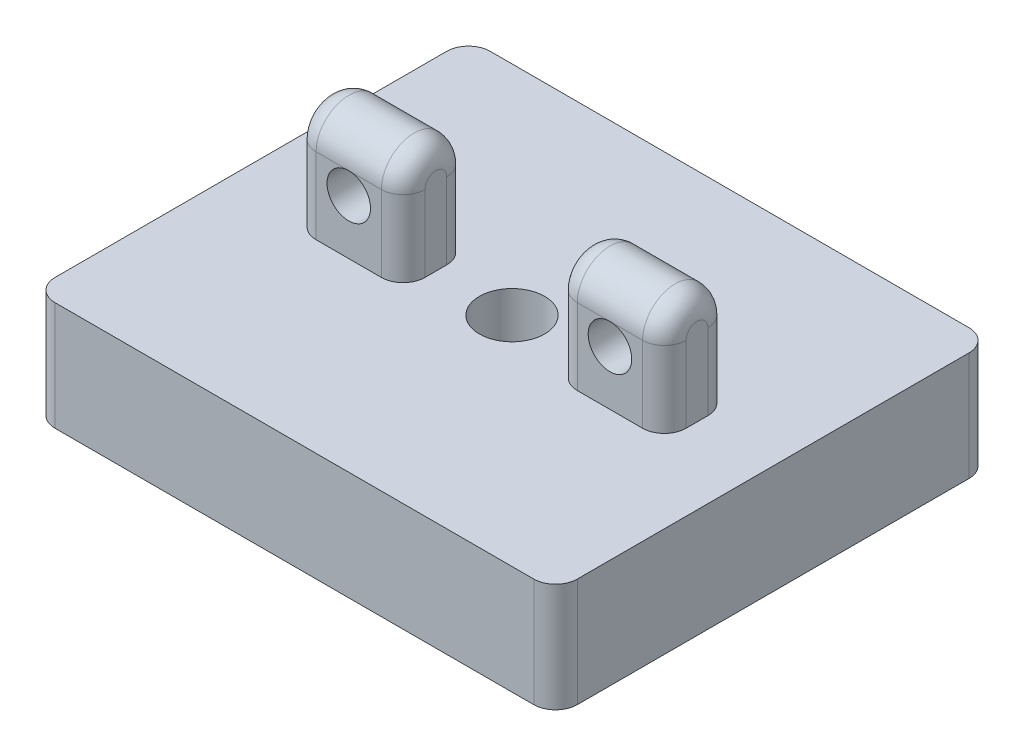
ISO-10303-21;
HEADER;
FILE_DESCRIPTION(('STEP AP214'),'2;1');
FILE_NAME('part.step','',(''),(''),'','','');
FILE_SCHEMA(('AUTOMOTIVE_DESIGN { 1 0 10303 214 1 1 1 1 }'));
ENDSEC;
DATA;
#1=APPLICATION_CONTEXT('core data for automotive mechanical design processes');
#2=APPLICATION_PROTOCOL_DEFINITION('international standard','automotive_design',2000,#1);
#3=PRODUCT_CONTEXT('',#1,'mechanical');
#4=PRODUCT('Part','Part','',(#3));
#5=PRODUCT_RELATED_PRODUCT_CATEGORY('part','',(#4));
#6=PRODUCT_DEFINITION_FORMATION('','',#4);
#7=PRODUCT_DEFINITION_CONTEXT('part definition',#1,'design');
#8=PRODUCT_DEFINITION('design','',#6,#7);
#9=PRODUCT_DEFINITION_SHAPE('','',#8);
#10=(LENGTH_UNIT() NAMED_UNIT(*) SI_UNIT(.MILLI.,.METRE.));
#11=(NAMED_UNIT(*) PLANE_ANGLE_UNIT() SI_UNIT($,.RADIAN.));
#12=(NAMED_UNIT(*) SI_UNIT($,.STERADIAN.) SOLID_ANGLE_UNIT());
#13=UNCERTAINTY_MEASURE_WITH_UNIT(LENGTH_MEASURE(1.E-05),#10,'distance_accuracy_value','');
#14=(GEOMETRIC_REPRESENTATION_CONTEXT(3) GLOBAL_UNCERTAINTY_ASSIGNED_CONTEXT((#13)) GLOBAL_UNIT_ASSIGNED_CONTEXT((#10,
#11,#12)) REPRESENTATION_CONTEXT('',''));
#15=CARTESIAN_POINT('',(0.,0.,0.));
#16=DIRECTION('',(0.,0.,1.));
#17=DIRECTION('',(1.,0.,0.));
#18=AXIS2_PLACEMENT_3D('',#15,#16,#17);
#19=CARTESIAN_POINT('',(-10.2716518723192,8.5,1.4335036773296));
#20=DIRECTION('',(-1.,0.,0.));
#21=DIRECTION('',(0.,0.,1.));
#22=AXIS2_PLACEMENT_3D('',#19,#20,#21);
#23=CYLINDRICAL_SURFACE('',#22,1.5);
#24=DIRECTION('',(-1.,0.,0.));
#25=VECTOR('',#24,1.);
#26=CARTESIAN_POINT('',(-10.2716518723192,8.5,-0.066496322670397));
#27=LINE('',#26,#25);
#28=CARTESIAN_POINT('',(-14.2716518723192,8.5,-0.066496322670397));
#29=VERTEX_POINT('',#28);
#30=CARTESIAN_POINT('',(-12.7716518723192,8.5,-0.066496322670397));
#31=VERTEX_POINT('',#30);
#32=EDGE_CURVE('E241',#29,#31,#27,.F.);
#33=ORIENTED_EDGE('',*,*,#32,.F.);
#34=CARTESIAN_POINT('',(-14.2716518723192,8.5,1.4335036773296));
#35=DIRECTION('',(1.,0.,0.));
#36=DIRECTION('',(0.,0.,-1.));
#37=AXIS2_PLACEMENT_3D('',#34,#35,#36);
#38=CIRCLE('',#37,1.5);
#39=CARTESIAN_POINT('',(-14.2716518723192,8.5,2.9335036773296));
#40=VERTEX_POINT('',#39);
#41=EDGE_CURVE('E353',#29,#40,#38,.T.);
#42=ORIENTED_EDGE('',*,*,#41,.T.);
#43=DIRECTION('',(1.,0.,0.));
#44=VECTOR('',#43,1.);
#45=CARTESIAN_POINT('',(-10.2716518723192,8.5,2.9335036773296));
#46=LINE('',#45,#44);
#47=CARTESIAN_POINT('',(-12.7716518723192,8.5,2.9335036773296));
#48=VERTEX_POINT('',#47);
#49=EDGE_CURVE('E267',#48,#40,#46,.F.);
#50=ORIENTED_EDGE('',*,*,#49,.F.);
#51=CARTESIAN_POINT('',(-11.2716518723192,8.5,2.9335036773296));
#52=VERTEX_POINT('',#51);
#53=EDGE_CURVE('E268',#52,#48,#46,.F.);
#54=ORIENTED_EDGE('',*,*,#53,.F.);
#55=CARTESIAN_POINT('',(-11.2716518723192,8.5,1.4335036773296));
#56=DIRECTION('',(1.,0.,0.));
#57=DIRECTION('',(0.,0.,-1.));
#58=AXIS2_PLACEMENT_3D('',#55,#56,#57);
#59=CIRCLE('',#58,1.5);
#60=CARTESIAN_POINT('',(-11.2716518723192,8.5,-0.066496322670397));
#61=VERTEX_POINT('',#60);
#62=EDGE_CURVE('E290',#52,#61,#59,.F.);
#63=ORIENTED_EDGE('',*,*,#62,.T.);
#64=EDGE_CURVE('E272',#31,#61,#27,.F.);
#65=ORIENTED_EDGE('',*,*,#64,.F.);
#66=EDGE_LOOP('',(#33,#42,#50,#54,#63,#65));
#67=FACE_BOUND('',#66,.T.);
#68=ADVANCED_FACE('F43',(#67),#23,.T.);
#69=CARTESIAN_POINT('',(-27.2716518723192,8.5,1.43350367732961));
#70=DIRECTION('',(1.,0.,0.));
#71=DIRECTION('',(0.,0.,-1.));
#72=AXIS2_PLACEMENT_3D('',#69,#70,#71);
#73=CYLINDRICAL_SURFACE('',#72,1.5);
#74=DIRECTION('',(-1.,0.,0.));
#75=VECTOR('',#74,1.);
#76=CARTESIAN_POINT('',(-27.2716518723192,8.5,-0.0664963226703935));
#77=LINE('',#76,#75);
#78=CARTESIAN_POINT('',(-26.2716518723192,8.5,-0.0664963226703935));
#79=VERTEX_POINT('',#78);
#80=CARTESIAN_POINT('',(-24.7716518723192,8.5,-0.0664963226703935));
#81=VERTEX_POINT('',#80);
#82=EDGE_CURVE('E259',#79,#81,#77,.F.);
#83=ORIENTED_EDGE('',*,*,#82,.F.);
#84=CARTESIAN_POINT('',(-26.2716518723192,8.5,1.43350367732961));
#85=DIRECTION('',(1.,0.,0.));
#86=DIRECTION('',(0.,0.,-1.));
#87=AXIS2_PLACEMENT_3D('',#84,#85,#86);
#88=CIRCLE('',#87,1.5);
#89=CARTESIAN_POINT('',(-26.2716518723192,8.5,2.93350367732961));
#90=VERTEX_POINT('',#89);
#91=EDGE_CURVE('E329',#79,#90,#88,.T.);
#92=ORIENTED_EDGE('',*,*,#91,.T.);
#93=DIRECTION('',(1.,0.,0.));
#94=VECTOR('',#93,1.);
#95=CARTESIAN_POINT('',(-27.2716518723192,8.5,2.93350367732961));
#96=LINE('',#95,#94);
#97=CARTESIAN_POINT('',(-24.7716518723192,8.5,2.93350367732961));
#98=VERTEX_POINT('',#97);
#99=EDGE_CURVE('E262',#98,#90,#96,.F.);
#100=ORIENTED_EDGE('',*,*,#99,.F.);
#101=CARTESIAN_POINT('',(-23.2716518723192,8.5,2.93350367732961));
#102=VERTEX_POINT('',#101);
#103=EDGE_CURVE('E264',#102,#98,#96,.F.);
#104=ORIENTED_EDGE('',*,*,#103,.F.);
#105=CARTESIAN_POINT('',(-23.2716518723192,8.5,1.43350367732961));
#106=DIRECTION('',(1.,0.,0.));
#107=DIRECTION('',(0.,0.,-1.));
#108=AXIS2_PLACEMENT_3D('',#105,#106,#107);
#109=CIRCLE('',#108,1.5);
#110=CARTESIAN_POINT('',(-23.2716518723192,8.5,-0.0664963226703935));
#111=VERTEX_POINT('',#110);
#112=EDGE_CURVE('E325',#102,#111,#109,.F.);
#113=ORIENTED_EDGE('',*,*,#112,.T.);
#114=EDGE_CURVE('E263',#81,#111,#77,.F.);
#115=ORIENTED_EDGE('',*,*,#114,.F.);
#116=EDGE_LOOP('',(#83,#92,#100,#104,#113,#115));
#117=FACE_BOUND('',#116,.T.);
#118=ADVANCED_FACE('F548',(#117),#73,.T.);
#119=CARTESIAN_POINT('',(-30.7716518723192,5.,-8.56649632267039));
#120=DIRECTION('',(1.,0.,0.));
#121=DIRECTION('',(0.,0.,-1.));
#122=AXIS2_PLACEMENT_3D('',#119,#120,#121);
#123=PLANE('',#122);
#124=DIRECTION('',(0.,0.,1.));
#125=VECTOR('',#124,1.);
#126=CARTESIAN_POINT('',(-30.7716518723192,5.,-8.56649632267039));
#127=LINE('',#126,#125);
#128=CARTESIAN_POINT('',(-30.7716518723192,5.,-7.56649632267039));
#129=VERTEX_POINT('',#128);
#130=CARTESIAN_POINT('',(-30.7716518723192,5.,10.4335036773296));
#131=VERTEX_POINT('',#130);
#132=EDGE_CURVE('E253',#129,#131,#127,.T.);
#133=ORIENTED_EDGE('',*,*,#132,.F.);
#134=DIRECTION('',(0.,-1.,0.));
#135=VECTOR('',#134,1.);
#136=CARTESIAN_POINT('',(-30.7716518723192,5.,-7.56649632267039));
#137=LINE('',#136,#135);
#138=CARTESIAN_POINT('',(-30.7716518723192,0.,-7.56649632267039));
#139=VERTEX_POINT('',#138);
#140=EDGE_CURVE('E52',#129,#139,#137,.T.);
#141=ORIENTED_EDGE('',*,*,#140,.T.);
#142=DIRECTION('',(0.,0.,1.));
#143=VECTOR('',#142,1.);
#144=CARTESIAN_POINT('',(-30.7716518723192,0.,-8.56649632267039));
#145=LINE('',#144,#143);
#146=CARTESIAN_POINT('',(-30.7716518723192,0.,10.4335036773296));
#147=VERTEX_POINT('',#146);
#148=EDGE_CURVE('E255',#139,#147,#145,.T.);
#149=ORIENTED_EDGE('',*,*,#148,.T.);
#150=DIRECTION('',(0.,-1.,0.));
#151=VECTOR('',#150,1.);
#152=CARTESIAN_POINT('',(-30.7716518723192,5.,10.4335036773296));
#153=LINE('',#152,#151);
#154=EDGE_CURVE('E59',#147,#131,#153,.F.);
#155=ORIENTED_EDGE('',*,*,#154,.T.);
#156=EDGE_LOOP('',(#133,#141,#149,#155));
#157=FACE_BOUND('',#156,.T.);
#158=ADVANCED_FACE('F443',(#157),#123,.F.);
#159=CARTESIAN_POINT('',(-30.7716518723192,5.,11.4335036773296));
#160=DIRECTION('',(0.,0.,-1.));
#161=DIRECTION('',(-1.,0.,0.));
#162=AXIS2_PLACEMENT_3D('',#159,#160,#161);
#163=PLANE('',#162);
#164=DIRECTION('',(1.,0.,0.));
#165=VECTOR('',#164,1.);
#166=CARTESIAN_POINT('',(-30.7716518723192,5.,11.4335036773296));
#167=LINE('',#166,#165);
#168=CARTESIAN_POINT('',(-29.7716518723192,5.,11.4335036773296));
#169=VERTEX_POINT('',#168);
#170=CARTESIAN_POINT('',(-7.77165187231917,5.,11.4335036773296));
#171=VERTEX_POINT('',#170);
#172=EDGE_CURVE('E457',#169,#171,#167,.T.);
#173=ORIENTED_EDGE('',*,*,#172,.F.);
#174=DIRECTION('',(0.,-1.,0.));
#175=VECTOR('',#174,1.);
#176=CARTESIAN_POINT('',(-29.7716518723192,5.,11.4335036773296));
#177=LINE('',#176,#175);
#178=CARTESIAN_POINT('',(-29.7716518723192,0.,11.4335036773296));
#179=VERTEX_POINT('',#178);
#180=EDGE_CURVE('E11',#169,#179,#177,.T.);
#181=ORIENTED_EDGE('',*,*,#180,.T.);
#182=DIRECTION('',(1.,0.,0.));
#183=VECTOR('',#182,1.);
#184=CARTESIAN_POINT('',(-30.7716518723192,0.,11.4335036773296));
#185=LINE('',#184,#183);
#186=CARTESIAN_POINT('',(-7.77165187231917,0.,11.4335036773296));
#187=VERTEX_POINT('',#186);
#188=EDGE_CURVE('E248',#179,#187,#185,.T.);
#189=ORIENTED_EDGE('',*,*,#188,.T.);
#190=DIRECTION('',(0.,-1.,0.));
#191=VECTOR('',#190,1.);
#192=CARTESIAN_POINT('',(-7.77165187231917,5.,11.4335036773296));
#193=LINE('',#192,#191);
#194=EDGE_CURVE('E226',#187,#171,#193,.F.);
#195=ORIENTED_EDGE('',*,*,#194,.T.);
#196=EDGE_LOOP('',(#173,#181,#189,#195));
#197=FACE_BOUND('',#196,.T.);
#198=ADVANCED_FACE('F721',(#197),#163,.F.);
#199=CARTESIAN_POINT('',(-6.77165187231918,5.,-8.56649632267039));
#200=DIRECTION('',(-1.,0.,0.));
#201=DIRECTION('',(0.,0.,1.));
#202=AXIS2_PLACEMENT_3D('',#199,#200,#201);
#203=PLANE('',#202);
#204=DIRECTION('',(0.,0.,-1.));
#205=VECTOR('',#204,1.);
#206=CARTESIAN_POINT('',(-6.77165187231918,0.,-8.56649632267039));
#207=LINE('',#206,#205);
#208=CARTESIAN_POINT('',(-6.77165187231917,0.,10.4335036773296));
#209=VERTEX_POINT('',#208);
#210=CARTESIAN_POINT('',(-6.77165187231918,0.,-7.56649632267039));
#211=VERTEX_POINT('',#210);
#212=EDGE_CURVE('E236',#209,#211,#207,.T.);
#213=ORIENTED_EDGE('',*,*,#212,.T.);
#214=DIRECTION('',(0.,-1.,0.));
#215=VECTOR('',#214,1.);
#216=CARTESIAN_POINT('',(-6.77165187231918,5.,-7.56649632267039));
#217=LINE('',#216,#215);
#218=CARTESIAN_POINT('',(-6.77165187231918,5.,-7.56649632267039));
#219=VERTEX_POINT('',#218);
#220=EDGE_CURVE('E427',#211,#219,#217,.F.);
#221=ORIENTED_EDGE('',*,*,#220,.T.);
#222=DIRECTION('',(0.,0.,-1.));
#223=VECTOR('',#222,1.);
#224=CARTESIAN_POINT('',(-6.77165187231918,5.,-8.56649632267039));
#225=LINE('',#224,#223);
#226=CARTESIAN_POINT('',(-6.77165187231917,5.,10.4335036773296));
#227=VERTEX_POINT('',#226);
#228=EDGE_CURVE('E239',#227,#219,#225,.T.);
#229=ORIENTED_EDGE('',*,*,#228,.F.);
#230=DIRECTION('',(0.,-1.,0.));
#231=VECTOR('',#230,1.);
#232=CARTESIAN_POINT('',(-6.77165187231917,5.,10.4335036773296));
#233=LINE('',#232,#231);
#234=EDGE_CURVE('E224',#227,#209,#233,.T.);
#235=ORIENTED_EDGE('',*,*,#234,.T.);
#236=EDGE_LOOP('',(#213,#221,#229,#235));
#237=FACE_BOUND('',#236,.T.);
#238=ADVANCED_FACE('F235',(#237),#203,.F.);
#239=CARTESIAN_POINT('',(-30.7716518723192,5.,-8.56649632267039));
#240=DIRECTION('',(0.,0.,1.));
#241=DIRECTION('',(1.,0.,0.));
#242=AXIS2_PLACEMENT_3D('',#239,#240,#241);
#243=PLANE('',#242);
#244=DIRECTION('',(-1.,0.,0.));
#245=VECTOR('',#244,1.);
#246=CARTESIAN_POINT('',(-30.7716518723192,5.,-8.56649632267039));
#247=LINE('',#246,#245);
#248=CARTESIAN_POINT('',(-7.77165187231918,5.,-8.56649632267039));
#249=VERTEX_POINT('',#248);
#250=CARTESIAN_POINT('',(-29.7716518723192,5.,-8.56649632267039));
#251=VERTEX_POINT('',#250);
#252=EDGE_CURVE('E452',#249,#251,#247,.T.);
#253=ORIENTED_EDGE('',*,*,#252,.F.);
#254=DIRECTION('',(0.,-1.,0.));
#255=VECTOR('',#254,1.);
#256=CARTESIAN_POINT('',(-7.77165187231918,5.,-8.56649632267039));
#257=LINE('',#256,#255);
#258=CARTESIAN_POINT('',(-7.77165187231918,0.,-8.56649632267039));
#259=VERTEX_POINT('',#258);
#260=EDGE_CURVE('E415',#249,#259,#257,.T.);
#261=ORIENTED_EDGE('',*,*,#260,.T.);
#262=DIRECTION('',(-1.,0.,0.));
#263=VECTOR('',#262,1.);
#264=CARTESIAN_POINT('',(-30.7716518723192,0.,-8.56649632267039));
#265=LINE('',#264,#263);
#266=CARTESIAN_POINT('',(-29.7716518723192,0.,-8.56649632267039));
#267=VERTEX_POINT('',#266);
#268=EDGE_CURVE('E247',#259,#267,#265,.T.);
#269=ORIENTED_EDGE('',*,*,#268,.T.);
#270=DIRECTION('',(0.,-1.,0.));
#271=VECTOR('',#270,1.);
#272=CARTESIAN_POINT('',(-29.7716518723192,5.,-8.56649632267039));
#273=LINE('',#272,#271);
#274=EDGE_CURVE('E392',#267,#251,#273,.F.);
#275=ORIENTED_EDGE('',*,*,#274,.T.);
#276=EDGE_LOOP('',(#253,#261,#269,#275));
#277=FACE_BOUND('',#276,.T.);
#278=ADVANCED_FACE('F524',(#277),#243,.F.);
#279=CARTESIAN_POINT('',(0.,5.,0.));
#280=DIRECTION('',(0.,1.,0.));
#281=DIRECTION('',(0.,0.,1.));
#282=AXIS2_PLACEMENT_3D('',#279,#280,#281);
#283=PLANE('',#282);
#284=CARTESIAN_POINT('',(-18.7716518723192,5.,1.43350367732961));
#285=DIRECTION('',(0.,1.,0.));
#286=DIRECTION('',(0.,0.,1.));
#287=AXIS2_PLACEMENT_3D('',#284,#285,#286);
#288=CIRCLE('',#287,1.5);
#289=CARTESIAN_POINT('',(-18.7716518723192,5.,2.93350367732961));
#290=VERTEX_POINT('',#289);
#291=EDGE_CURVE('E315',#290,#290,#288,.T.);
#292=ORIENTED_EDGE('',*,*,#291,.F.);
#293=EDGE_LOOP('',(#292));
#294=FACE_BOUND('',#293,.T.);
#295=DIRECTION('',(-1.,0.,0.));
#296=VECTOR('',#295,1.);
#297=CARTESIAN_POINT('',(-10.2716518723192,5.,-0.066496322670397));
#298=LINE('',#297,#296);
#299=CARTESIAN_POINT('',(-11.2716518723192,5.,-0.066496322670397));
#300=VERTEX_POINT('',#299);
#301=CARTESIAN_POINT('',(-14.2716518723192,5.,-0.066496322670397));
#302=VERTEX_POINT('',#301);
#303=EDGE_CURVE('E485',#300,#302,#298,.T.);
#304=ORIENTED_EDGE('',*,*,#303,.F.);
#305=CARTESIAN_POINT('',(-11.2716518723192,5.,0.933503677329603));
#306=DIRECTION('',(0.,1.,0.));
#307=DIRECTION('',(0.,0.,1.));
#308=AXIS2_PLACEMENT_3D('',#305,#306,#307);
#309=CIRCLE('',#308,1.);
#310=CARTESIAN_POINT('',(-10.2716518723192,5.,0.933503677329603));
#311=VERTEX_POINT('',#310);
#312=EDGE_CURVE('E300',#300,#311,#309,.F.);
#313=ORIENTED_EDGE('',*,*,#312,.T.);
#314=DIRECTION('',(0.,0.,1.));
#315=VECTOR('',#314,1.);
#316=CARTESIAN_POINT('',(-10.2716518723192,5.,-0.066496322670397));
#317=LINE('',#316,#315);
#318=CARTESIAN_POINT('',(-10.2716518723192,5.,1.9335036773296));
#319=VERTEX_POINT('',#318);
#320=EDGE_CURVE('E473',#311,#319,#317,.T.);
#321=ORIENTED_EDGE('',*,*,#320,.T.);
#322=CARTESIAN_POINT('',(-11.2716518723192,5.,1.9335036773296));
#323=DIRECTION('',(0.,1.,0.));
#324=DIRECTION('',(0.,0.,1.));
#325=AXIS2_PLACEMENT_3D('',#322,#323,#324);
#326=CIRCLE('',#325,1.);
#327=CARTESIAN_POINT('',(-11.2716518723192,5.,2.9335036773296));
#328=VERTEX_POINT('',#327);
#329=EDGE_CURVE('E303',#319,#328,#326,.F.);
#330=ORIENTED_EDGE('',*,*,#329,.T.);
#331=DIRECTION('',(-1.,0.,0.));
#332=VECTOR('',#331,1.);
#333=CARTESIAN_POINT('',(-10.2716518723192,5.,2.9335036773296));
#334=LINE('',#333,#332);
#335=CARTESIAN_POINT('',(-14.2716518723192,5.,2.9335036773296));
#336=VERTEX_POINT('',#335);
#337=EDGE_CURVE('E477',#328,#336,#334,.T.);
#338=ORIENTED_EDGE('',*,*,#337,.T.);
#339=CARTESIAN_POINT('',(-14.2716518723192,5.,1.9335036773296));
#340=DIRECTION('',(0.,1.,0.));
#341=DIRECTION('',(0.,0.,1.));
#342=AXIS2_PLACEMENT_3D('',#339,#340,#341);
#343=CIRCLE('',#342,1.);
#344=CARTESIAN_POINT('',(-15.2716518723192,5.,1.9335036773296));
#345=VERTEX_POINT('',#344);
#346=EDGE_CURVE('E386',#336,#345,#343,.F.);
#347=ORIENTED_EDGE('',*,*,#346,.T.);
#348=DIRECTION('',(0.,0.,1.));
#349=VECTOR('',#348,1.);
#350=CARTESIAN_POINT('',(-15.2716518723192,5.,-0.066496322670397));
#351=LINE('',#350,#349);
#352=CARTESIAN_POINT('',(-15.2716518723192,5.,0.933503677329603));
#353=VERTEX_POINT('',#352);
#354=EDGE_CURVE('E481',#353,#345,#351,.T.);
#355=ORIENTED_EDGE('',*,*,#354,.F.);
#356=CARTESIAN_POINT('',(-14.2716518723192,5.,0.933503677329603));
#357=DIRECTION('',(0.,1.,0.));
#358=DIRECTION('',(0.,0.,1.));
#359=AXIS2_PLACEMENT_3D('',#356,#357,#358);
#360=CIRCLE('',#359,1.);
#361=EDGE_CURVE('E389',#353,#302,#360,.F.);
#362=ORIENTED_EDGE('',*,*,#361,.T.);
#363=EDGE_LOOP('',(#304,#313,#321,#330,#338,#347,#355,#362));
#364=FACE_BOUND('',#363,.T.);
#365=DIRECTION('',(0.,0.,1.));
#366=VECTOR('',#365,1.);
#367=CARTESIAN_POINT('',(-27.2716518723192,5.,-0.0664963226703935));
#368=LINE('',#367,#366);
#369=CARTESIAN_POINT('',(-27.2716518723192,5.,0.933503677329606));
#370=VERTEX_POINT('',#369);
#371=CARTESIAN_POINT('',(-27.2716518723192,5.,1.93350367732961));
#372=VERTEX_POINT('',#371);
#373=EDGE_CURVE('E446',#370,#372,#368,.T.);
#374=ORIENTED_EDGE('',*,*,#373,.F.);
#375=CARTESIAN_POINT('',(-26.2716518723192,5.,0.933503677329606));
#376=DIRECTION('',(0.,1.,0.));
#377=DIRECTION('',(0.,0.,1.));
#378=AXIS2_PLACEMENT_3D('',#375,#376,#377);
#379=CIRCLE('',#378,1.);
#380=CARTESIAN_POINT('',(-26.2716518723192,5.,-0.0664963226703935));
#381=VERTEX_POINT('',#380);
#382=EDGE_CURVE('E374',#370,#381,#379,.F.);
#383=ORIENTED_EDGE('',*,*,#382,.T.);
#384=DIRECTION('',(1.,0.,0.));
#385=VECTOR('',#384,1.);
#386=CARTESIAN_POINT('',(-27.2716518723192,5.,-0.0664963226703935));
#387=LINE('',#386,#385);
#388=CARTESIAN_POINT('',(-23.2716518723192,5.,-0.0664963226703935));
#389=VERTEX_POINT('',#388);
#390=EDGE_CURVE('E469',#381,#389,#387,.T.);
#391=ORIENTED_EDGE('',*,*,#390,.T.);
#392=CARTESIAN_POINT('',(-23.2716518723192,5.,0.933503677329606));
#393=DIRECTION('',(0.,1.,0.));
#394=DIRECTION('',(0.,0.,1.));
#395=AXIS2_PLACEMENT_3D('',#392,#393,#394);
#396=CIRCLE('',#395,1.);
#397=CARTESIAN_POINT('',(-22.2716518723192,5.,0.933503677329606));
#398=VERTEX_POINT('',#397);
#399=EDGE_CURVE('E383',#389,#398,#396,.F.);
#400=ORIENTED_EDGE('',*,*,#399,.T.);
#401=DIRECTION('',(0.,0.,1.));
#402=VECTOR('',#401,1.);
#403=CARTESIAN_POINT('',(-22.2716518723192,5.,-0.0664963226703935));
#404=LINE('',#403,#402);
#405=CARTESIAN_POINT('',(-22.2716518723192,5.,1.93350367732961));
#406=VERTEX_POINT('',#405);
#407=EDGE_CURVE('E465',#398,#406,#404,.T.);
#408=ORIENTED_EDGE('',*,*,#407,.T.);
#409=CARTESIAN_POINT('',(-23.2716518723192,5.,1.93350367732961));
#410=DIRECTION('',(0.,1.,0.));
#411=DIRECTION('',(0.,0.,1.));
#412=AXIS2_PLACEMENT_3D('',#409,#410,#411);
#413=CIRCLE('',#412,1.);
#414=CARTESIAN_POINT('',(-23.2716518723192,5.,2.93350367732961));
#415=VERTEX_POINT('',#414);
#416=EDGE_CURVE('E380',#406,#415,#413,.F.);
#417=ORIENTED_EDGE('',*,*,#416,.T.);
#418=DIRECTION('',(1.,0.,0.));
#419=VECTOR('',#418,1.);
#420=CARTESIAN_POINT('',(-27.2716518723192,5.,2.93350367732961));
#421=LINE('',#420,#419);
#422=CARTESIAN_POINT('',(-26.2716518723192,5.,2.93350367732961));
#423=VERTEX_POINT('',#422);
#424=EDGE_CURVE('E449',#423,#415,#421,.T.);
#425=ORIENTED_EDGE('',*,*,#424,.F.);
#426=CARTESIAN_POINT('',(-26.2716518723192,5.,1.93350367732961));
#427=DIRECTION('',(0.,1.,0.));
#428=DIRECTION('',(0.,0.,1.));
#429=AXIS2_PLACEMENT_3D('',#426,#427,#428);
#430=CIRCLE('',#429,1.);
#431=EDGE_CURVE('E377',#423,#372,#430,.F.);
#432=ORIENTED_EDGE('',*,*,#431,.T.);
#433=EDGE_LOOP('',(#374,#383,#391,#400,#408,#417,#425,#432));
#434=FACE_BOUND('',#433,.T.);
#435=ORIENTED_EDGE('',*,*,#228,.T.);
#436=CARTESIAN_POINT('',(-7.77165187231918,5.,-7.56649632267039));
#437=DIRECTION('',(0.,1.,0.));
#438=DIRECTION('',(0.,0.,1.));
#439=AXIS2_PLACEMENT_3D('',#436,#437,#438);
#440=CIRCLE('',#439,1.);
#441=EDGE_CURVE('E435',#219,#249,#440,.T.);
#442=ORIENTED_EDGE('',*,*,#441,.T.);
#443=ORIENTED_EDGE('',*,*,#252,.T.);
#444=CARTESIAN_POINT('',(-29.7716518723192,5.,-7.56649632267039));
#445=DIRECTION('',(0.,1.,0.));
#446=DIRECTION('',(0.,0.,1.));
#447=AXIS2_PLACEMENT_3D('',#444,#445,#446);
#448=CIRCLE('',#447,1.);
#449=EDGE_CURVE('E66',#251,#129,#448,.T.);
#450=ORIENTED_EDGE('',*,*,#449,.T.);
#451=ORIENTED_EDGE('',*,*,#132,.T.);
#452=CARTESIAN_POINT('',(-29.7716518723192,5.,10.4335036773296));
#453=DIRECTION('',(0.,1.,0.));
#454=DIRECTION('',(0.,0.,1.));
#455=AXIS2_PLACEMENT_3D('',#452,#453,#454);
#456=CIRCLE('',#455,1.);
#457=EDGE_CURVE('E430',#131,#169,#456,.T.);
#458=ORIENTED_EDGE('',*,*,#457,.T.);
#459=ORIENTED_EDGE('',*,*,#172,.T.);
#460=CARTESIAN_POINT('',(-7.77165187231917,5.,10.4335036773296));
#461=DIRECTION('',(0.,1.,0.));
#462=DIRECTION('',(0.,0.,1.));
#463=AXIS2_PLACEMENT_3D('',#460,#461,#462);
#464=CIRCLE('',#463,1.);
#465=EDGE_CURVE('E277',#171,#227,#464,.T.);
#466=ORIENTED_EDGE('',*,*,#465,.T.);
#467=EDGE_LOOP('',(#435,#442,#443,#450,#451,#458,#459,#466));
#468=FACE_BOUND('',#467,.T.);
#469=ADVANCED_FACE('F521',(#294,#364,#434,#468),#283,.T.);
#470=CARTESIAN_POINT('',(0.,0.,0.));
#471=DIRECTION('',(0.,1.,0.));
#472=DIRECTION('',(0.,0.,1.));
#473=AXIS2_PLACEMENT_3D('',#470,#471,#472);
#474=PLANE('',#473);
#475=CARTESIAN_POINT('',(-18.7716518723192,0.,1.43350367732961));
#476=DIRECTION('',(0.,1.,0.));
#477=DIRECTION('',(0.,0.,1.));
#478=AXIS2_PLACEMENT_3D('',#475,#476,#477);
#479=CIRCLE('',#478,1.5);
#480=CARTESIAN_POINT('',(-18.7716518723192,0.,2.93350367732961));
#481=VERTEX_POINT('',#480);
#482=EDGE_CURVE('E502',#481,#481,#479,.T.);
#483=ORIENTED_EDGE('',*,*,#482,.T.);
#484=EDGE_LOOP('',(#483));
#485=FACE_BOUND('',#484,.T.);
#486=ORIENTED_EDGE('',*,*,#268,.F.);
#487=CARTESIAN_POINT('',(-7.77165187231918,0.,-7.56649632267039));
#488=DIRECTION('',(0.,1.,0.));
#489=DIRECTION('',(0.,0.,1.));
#490=AXIS2_PLACEMENT_3D('',#487,#488,#489);
#491=CIRCLE('',#490,1.);
#492=EDGE_CURVE('E245',#259,#211,#491,.F.);
#493=ORIENTED_EDGE('',*,*,#492,.T.);
#494=ORIENTED_EDGE('',*,*,#212,.F.);
#495=CARTESIAN_POINT('',(-7.77165187231917,0.,10.4335036773296));
#496=DIRECTION('',(0.,1.,0.));
#497=DIRECTION('',(0.,0.,1.));
#498=AXIS2_PLACEMENT_3D('',#495,#496,#497);
#499=CIRCLE('',#498,1.);
#500=EDGE_CURVE('E220',#209,#187,#499,.F.);
#501=ORIENTED_EDGE('',*,*,#500,.T.);
#502=ORIENTED_EDGE('',*,*,#188,.F.);
#503=CARTESIAN_POINT('',(-29.7716518723192,0.,10.4335036773296));
#504=DIRECTION('',(0.,1.,0.));
#505=DIRECTION('',(0.,0.,1.));
#506=AXIS2_PLACEMENT_3D('',#503,#504,#505);
#507=CIRCLE('',#506,1.);
#508=EDGE_CURVE('E419',#179,#147,#507,.F.);
#509=ORIENTED_EDGE('',*,*,#508,.T.);
#510=ORIENTED_EDGE('',*,*,#148,.F.);
#511=CARTESIAN_POINT('',(-29.7716518723192,0.,-7.56649632267039));
#512=DIRECTION('',(0.,1.,0.));
#513=DIRECTION('',(0.,0.,1.));
#514=AXIS2_PLACEMENT_3D('',#511,#512,#513);
#515=CIRCLE('',#514,1.);
#516=EDGE_CURVE('E422',#139,#267,#515,.F.);
#517=ORIENTED_EDGE('',*,*,#516,.T.);
#518=EDGE_LOOP('',(#486,#493,#494,#501,#502,#509,#510,#517));
#519=FACE_BOUND('',#518,.T.);
#520=ADVANCED_FACE('F244',(#485,#519),#474,.F.);
#521=CARTESIAN_POINT('',(-27.2716518723192,10.,-0.0664963226703935));
#522=DIRECTION('',(0.,0.,-1.));
#523=DIRECTION('',(-1.,0.,0.));
#524=AXIS2_PLACEMENT_3D('',#521,#522,#523);
#525=PLANE('',#524);
#526=CARTESIAN_POINT('',(-24.7716518723192,7.5,-0.0664963226703935));
#527=DIRECTION('',(0.,0.,-1.));
#528=DIRECTION('',(-1.,0.,0.));
#529=AXIS2_PLACEMENT_3D('',#526,#527,#528);
#530=CIRCLE('',#529,1.);
#531=EDGE_CURVE('E498',#81,#81,#530,.T.);
#532=ORIENTED_EDGE('',*,*,#531,.F.);
#533=ORIENTED_EDGE('',*,*,#114,.T.);
#534=DIRECTION('',(0.,-1.,0.));
#535=VECTOR('',#534,1.);
#536=CARTESIAN_POINT('',(-23.2716518723192,10.,-0.0664963226703935));
#537=LINE('',#536,#535);
#538=EDGE_CURVE('E356',#111,#389,#537,.T.);
#539=ORIENTED_EDGE('',*,*,#538,.T.);
#540=ORIENTED_EDGE('',*,*,#390,.F.);
#541=DIRECTION('',(0.,-1.,0.));
#542=VECTOR('',#541,1.);
#543=CARTESIAN_POINT('',(-26.2716518723192,8.5,-0.0664963226703935));
#544=LINE('',#543,#542);
#545=EDGE_CURVE('E359',#381,#79,#544,.F.);
#546=ORIENTED_EDGE('',*,*,#545,.T.);
#547=ORIENTED_EDGE('',*,*,#82,.T.);
#548=EDGE_LOOP('',(#532,#533,#539,#540,#546,#547));
#549=FACE_BOUND('',#548,.T.);
#550=ADVANCED_FACE('F655',(#549),#525,.T.);
#551=CARTESIAN_POINT('',(-27.2716518723192,10.,-0.0664963226703935));
#552=DIRECTION('',(1.,0.,0.));
#553=DIRECTION('',(0.,0.,-1.));
#554=AXIS2_PLACEMENT_3D('',#551,#552,#553);
#555=PLANE('',#554);
#556=CARTESIAN_POINT('',(-27.2716518723192,8.5,1.43350367732961));
#557=DIRECTION('',(1.,0.,0.));
#558=DIRECTION('',(0.,0.,-1.));
#559=AXIS2_PLACEMENT_3D('',#556,#557,#558);
#560=CIRCLE('',#559,0.5);
#561=CARTESIAN_POINT('',(-27.2716518723192,8.5,1.93350367732961));
#562=VERTEX_POINT('',#561);
#563=CARTESIAN_POINT('',(-27.2716518723192,8.5,0.933503677329607));
#564=VERTEX_POINT('',#563);
#565=EDGE_CURVE('E318',#562,#564,#560,.F.);
#566=ORIENTED_EDGE('',*,*,#565,.T.);
#567=DIRECTION('',(0.,-1.,0.));
#568=VECTOR('',#567,1.);
#569=CARTESIAN_POINT('',(-27.2716518723192,5.,0.933503677329606));
#570=LINE('',#569,#568);
#571=EDGE_CURVE('E322',#564,#370,#570,.T.);
#572=ORIENTED_EDGE('',*,*,#571,.T.);
#573=ORIENTED_EDGE('',*,*,#373,.T.);
#574=DIRECTION('',(0.,-1.,0.));
#575=VECTOR('',#574,1.);
#576=CARTESIAN_POINT('',(-27.2716518723192,10.,1.93350367732961));
#577=LINE('',#576,#575);
#578=EDGE_CURVE('E306',#372,#562,#577,.F.);
#579=ORIENTED_EDGE('',*,*,#578,.T.);
#580=EDGE_LOOP('',(#566,#572,#573,#579));
#581=FACE_BOUND('',#580,.T.);
#582=ADVANCED_FACE('F682',(#581),#555,.F.);
#583=CARTESIAN_POINT('',(-27.2716518723192,10.,2.93350367732961));
#584=DIRECTION('',(0.,0.,-1.));
#585=DIRECTION('',(-1.,0.,0.));
#586=AXIS2_PLACEMENT_3D('',#583,#584,#585);
#587=PLANE('',#586);
#588=CARTESIAN_POINT('',(-24.7716518723192,7.5,2.93350367732961));
#589=DIRECTION('',(0.,0.,-1.));
#590=DIRECTION('',(-1.,0.,0.));
#591=AXIS2_PLACEMENT_3D('',#588,#589,#590);
#592=CIRCLE('',#591,1.);
#593=EDGE_CURVE('E494',#98,#98,#592,.T.);
#594=ORIENTED_EDGE('',*,*,#593,.T.);
#595=ORIENTED_EDGE('',*,*,#99,.T.);
#596=DIRECTION('',(0.,-1.,0.));
#597=VECTOR('',#596,1.);
#598=CARTESIAN_POINT('',(-26.2716518723192,10.,2.93350367732961));
#599=LINE('',#598,#597);
#600=EDGE_CURVE('E365',#90,#423,#599,.T.);
#601=ORIENTED_EDGE('',*,*,#600,.T.);
#602=ORIENTED_EDGE('',*,*,#424,.T.);
#603=DIRECTION('',(0.,-1.,0.));
#604=VECTOR('',#603,1.);
#605=CARTESIAN_POINT('',(-23.2716518723192,8.5,2.93350367732961));
#606=LINE('',#605,#604);
#607=EDGE_CURVE('E362',#415,#102,#606,.F.);
#608=ORIENTED_EDGE('',*,*,#607,.T.);
#609=ORIENTED_EDGE('',*,*,#103,.T.);
#610=EDGE_LOOP('',(#594,#595,#601,#602,#608,#609));
#611=FACE_BOUND('',#610,.T.);
#612=ADVANCED_FACE('F675',(#611),#587,.F.);
#613=CARTESIAN_POINT('',(-22.2716518723192,10.,-0.0664963226703935));
#614=DIRECTION('',(1.,0.,0.));
#615=DIRECTION('',(0.,0.,-1.));
#616=AXIS2_PLACEMENT_3D('',#613,#614,#615);
#617=PLANE('',#616);
#618=CARTESIAN_POINT('',(-22.2716518723192,8.5,1.43350367732961));
#619=DIRECTION('',(1.,0.,0.));
#620=DIRECTION('',(0.,0.,-1.));
#621=AXIS2_PLACEMENT_3D('',#618,#619,#620);
#622=CIRCLE('',#621,0.5);
#623=CARTESIAN_POINT('',(-22.2716518723192,8.5,0.933503677329606));
#624=VERTEX_POINT('',#623);
#625=CARTESIAN_POINT('',(-22.2716518723192,8.5,1.93350367732961));
#626=VERTEX_POINT('',#625);
#627=EDGE_CURVE('E336',#624,#626,#622,.T.);
#628=ORIENTED_EDGE('',*,*,#627,.T.);
#629=DIRECTION('',(0.,-1.,0.));
#630=VECTOR('',#629,1.);
#631=CARTESIAN_POINT('',(-22.2716518723192,5.,1.93350367732961));
#632=LINE('',#631,#630);
#633=EDGE_CURVE('E340',#626,#406,#632,.T.);
#634=ORIENTED_EDGE('',*,*,#633,.T.);
#635=ORIENTED_EDGE('',*,*,#407,.F.);
#636=DIRECTION('',(0.,-1.,0.));
#637=VECTOR('',#636,1.);
#638=CARTESIAN_POINT('',(-22.2716518723192,10.,0.933503677329606));
#639=LINE('',#638,#637);
#640=EDGE_CURVE('E333',#398,#624,#639,.F.);
#641=ORIENTED_EDGE('',*,*,#640,.T.);
#642=EDGE_LOOP('',(#628,#634,#635,#641));
#643=FACE_BOUND('',#642,.T.);
#644=ADVANCED_FACE('F669',(#643),#617,.T.);
#645=CARTESIAN_POINT('',(-10.2716518723192,10.,-0.066496322670397));
#646=DIRECTION('',(1.,0.,0.));
#647=DIRECTION('',(0.,0.,-1.));
#648=AXIS2_PLACEMENT_3D('',#645,#646,#647);
#649=PLANE('',#648);
#650=ORIENTED_EDGE('',*,*,#320,.F.);
#651=DIRECTION('',(0.,-1.,0.));
#652=VECTOR('',#651,1.);
#653=CARTESIAN_POINT('',(-10.2716518723192,8.5,0.933503677329603));
#654=LINE('',#653,#652);
#655=CARTESIAN_POINT('',(-10.2716518723192,8.5,0.933503677329603));
#656=VERTEX_POINT('',#655);
#657=EDGE_CURVE('E287',#311,#656,#654,.F.);
#658=ORIENTED_EDGE('',*,*,#657,.T.);
#659=CARTESIAN_POINT('',(-10.2716518723192,8.5,1.4335036773296));
#660=DIRECTION('',(1.,0.,0.));
#661=DIRECTION('',(0.,0.,-1.));
#662=AXIS2_PLACEMENT_3D('',#659,#660,#661);
#663=CIRCLE('',#662,0.5);
#664=CARTESIAN_POINT('',(-10.2716518723192,8.5,1.9335036773296));
#665=VERTEX_POINT('',#664);
#666=EDGE_CURVE('E283',#656,#665,#663,.T.);
#667=ORIENTED_EDGE('',*,*,#666,.T.);
#668=DIRECTION('',(0.,-1.,0.));
#669=VECTOR('',#668,1.);
#670=CARTESIAN_POINT('',(-10.2716518723192,10.,1.9335036773296));
#671=LINE('',#670,#669);
#672=EDGE_CURVE('E280',#665,#319,#671,.T.);
#673=ORIENTED_EDGE('',*,*,#672,.T.);
#674=EDGE_LOOP('',(#650,#658,#667,#673));
#675=FACE_BOUND('',#674,.T.);
#676=ADVANCED_FACE('F639',(#675),#649,.T.);
#677=CARTESIAN_POINT('',(-10.2716518723192,10.,-0.066496322670397));
#678=DIRECTION('',(0.,0.,1.));
#679=DIRECTION('',(1.,0.,0.));
#680=AXIS2_PLACEMENT_3D('',#677,#678,#679);
#681=PLANE('',#680);
#682=ORIENTED_EDGE('',*,*,#303,.T.);
#683=DIRECTION('',(0.,-1.,0.));
#684=VECTOR('',#683,1.);
#685=CARTESIAN_POINT('',(-14.2716518723192,10.,-0.066496322670397));
#686=LINE('',#685,#684);
#687=EDGE_CURVE('E371',#302,#29,#686,.F.);
#688=ORIENTED_EDGE('',*,*,#687,.T.);
#689=ORIENTED_EDGE('',*,*,#32,.T.);
#690=CARTESIAN_POINT('',(-12.7716518723192,7.5,-0.066496322670397));
#691=DIRECTION('',(0.,0.,-1.));
#692=DIRECTION('',(-1.,0.,0.));
#693=AXIS2_PLACEMENT_3D('',#690,#691,#692);
#694=CIRCLE('',#693,1.);
#695=EDGE_CURVE('E490',#31,#31,#694,.T.);
#696=ORIENTED_EDGE('',*,*,#695,.F.);
#697=ORIENTED_EDGE('',*,*,#64,.T.);
#698=DIRECTION('',(0.,-1.,0.));
#699=VECTOR('',#698,1.);
#700=CARTESIAN_POINT('',(-11.2716518723192,5.,-0.066496322670397));
#701=LINE('',#700,#699);
#702=EDGE_CURVE('E294',#61,#300,#701,.T.);
#703=ORIENTED_EDGE('',*,*,#702,.T.);
#704=EDGE_LOOP('',(#682,#688,#689,#696,#697,#703));
#705=FACE_BOUND('',#704,.T.);
#706=ADVANCED_FACE('F627',(#705),#681,.F.);
#707=CARTESIAN_POINT('',(-15.2716518723192,10.,-0.066496322670397));
#708=DIRECTION('',(1.,0.,0.));
#709=DIRECTION('',(0.,0.,-1.));
#710=AXIS2_PLACEMENT_3D('',#707,#708,#709);
#711=PLANE('',#710);
#712=ORIENTED_EDGE('',*,*,#354,.T.);
#713=DIRECTION('',(0.,-1.,0.));
#714=VECTOR('',#713,1.);
#715=CARTESIAN_POINT('',(-15.2716518723192,8.5,1.9335036773296));
#716=LINE('',#715,#714);
#717=CARTESIAN_POINT('',(-15.2716518723192,8.5,1.9335036773296));
#718=VERTEX_POINT('',#717);
#719=EDGE_CURVE('E350',#345,#718,#716,.F.);
#720=ORIENTED_EDGE('',*,*,#719,.T.);
#721=CARTESIAN_POINT('',(-15.2716518723192,8.5,1.4335036773296));
#722=DIRECTION('',(1.,0.,0.));
#723=DIRECTION('',(0.,0.,-1.));
#724=AXIS2_PLACEMENT_3D('',#721,#722,#723);
#725=CIRCLE('',#724,0.5);
#726=CARTESIAN_POINT('',(-15.2716518723192,8.5,0.933503677329603));
#727=VERTEX_POINT('',#726);
#728=EDGE_CURVE('E346',#718,#727,#725,.F.);
#729=ORIENTED_EDGE('',*,*,#728,.T.);
#730=DIRECTION('',(0.,-1.,0.));
#731=VECTOR('',#730,1.);
#732=CARTESIAN_POINT('',(-15.2716518723192,10.,0.933503677329603));
#733=LINE('',#732,#731);
#734=EDGE_CURVE('E343',#727,#353,#733,.T.);
#735=ORIENTED_EDGE('',*,*,#734,.T.);
#736=EDGE_LOOP('',(#712,#720,#729,#735));
#737=FACE_BOUND('',#736,.T.);
#738=ADVANCED_FACE('F621',(#737),#711,.F.);
#739=CARTESIAN_POINT('',(-10.2716518723192,10.,2.9335036773296));
#740=DIRECTION('',(0.,0.,1.));
#741=DIRECTION('',(1.,0.,0.));
#742=AXIS2_PLACEMENT_3D('',#739,#740,#741);
#743=PLANE('',#742);
#744=ORIENTED_EDGE('',*,*,#49,.T.);
#745=DIRECTION('',(0.,-1.,0.));
#746=VECTOR('',#745,1.);
#747=CARTESIAN_POINT('',(-14.2716518723192,5.,2.9335036773296));
#748=LINE('',#747,#746);
#749=EDGE_CURVE('E368',#40,#336,#748,.T.);
#750=ORIENTED_EDGE('',*,*,#749,.T.);
#751=ORIENTED_EDGE('',*,*,#337,.F.);
#752=DIRECTION('',(0.,-1.,0.));
#753=VECTOR('',#752,1.);
#754=CARTESIAN_POINT('',(-11.2716518723192,10.,2.9335036773296));
#755=LINE('',#754,#753);
#756=EDGE_CURVE('E297',#328,#52,#755,.F.);
#757=ORIENTED_EDGE('',*,*,#756,.T.);
#758=ORIENTED_EDGE('',*,*,#53,.T.);
#759=CARTESIAN_POINT('',(-12.7716518723192,7.5,2.9335036773296));
#760=DIRECTION('',(0.,0.,-1.));
#761=DIRECTION('',(-1.,0.,0.));
#762=AXIS2_PLACEMENT_3D('',#759,#760,#761);
#763=CIRCLE('',#762,1.);
#764=EDGE_CURVE('E489',#48,#48,#763,.T.);
#765=ORIENTED_EDGE('',*,*,#764,.T.);
#766=EDGE_LOOP('',(#744,#750,#751,#757,#758,#765));
#767=FACE_BOUND('',#766,.T.);
#768=ADVANCED_FACE('F645',(#767),#743,.T.);
#769=CARTESIAN_POINT('',(-12.7716518723192,7.5,2.9335036773296));
#770=DIRECTION('',(0.,0.,-1.));
#771=DIRECTION('',(-1.,0.,0.));
#772=AXIS2_PLACEMENT_3D('',#769,#770,#771);
#773=CYLINDRICAL_SURFACE('',#772,1.);
#774=ORIENTED_EDGE('',*,*,#764,.F.);
#775=EDGE_LOOP('',(#774));
#776=FACE_BOUND('',#775,.T.);
#777=ORIENTED_EDGE('',*,*,#695,.T.);
#778=EDGE_LOOP('',(#777));
#779=FACE_BOUND('',#778,.T.);
#780=ADVANCED_FACE('F691',(#776,#779),#773,.F.);
#781=CARTESIAN_POINT('',(-24.7716518723192,7.5,2.93350367732961));
#782=DIRECTION('',(0.,0.,-1.));
#783=DIRECTION('',(-1.,0.,0.));
#784=AXIS2_PLACEMENT_3D('',#781,#782,#783);
#785=CYLINDRICAL_SURFACE('',#784,1.);
#786=ORIENTED_EDGE('',*,*,#593,.F.);
#787=EDGE_LOOP('',(#786));
#788=FACE_BOUND('',#787,.T.);
#789=ORIENTED_EDGE('',*,*,#531,.T.);
#790=EDGE_LOOP('',(#789));
#791=FACE_BOUND('',#790,.T.);
#792=ADVANCED_FACE('F517',(#788,#791),#785,.F.);
#793=CARTESIAN_POINT('',(-18.7716518723192,0.,1.43350367732961));
#794=DIRECTION('',(0.,1.,0.));
#795=DIRECTION('',(0.,0.,1.));
#796=AXIS2_PLACEMENT_3D('',#793,#794,#795);
#797=CYLINDRICAL_SURFACE('',#796,1.5);
#798=ORIENTED_EDGE('',*,*,#482,.F.);
#799=EDGE_LOOP('',(#798));
#800=FACE_BOUND('',#799,.T.);
#801=ORIENTED_EDGE('',*,*,#291,.T.);
#802=EDGE_LOOP('',(#801));
#803=FACE_BOUND('',#802,.T.);
#804=ADVANCED_FACE('F514',(#800,#803),#797,.F.);
#805=CARTESIAN_POINT('',(-7.77165187231917,5.,10.4335036773296));
#806=DIRECTION('',(0.,-1.,0.));
#807=DIRECTION('',(0.,0.,-1.));
#808=AXIS2_PLACEMENT_3D('',#805,#806,#807);
#809=CYLINDRICAL_SURFACE('',#808,1.);
#810=ORIENTED_EDGE('',*,*,#465,.F.);
#811=ORIENTED_EDGE('',*,*,#194,.F.);
#812=ORIENTED_EDGE('',*,*,#500,.F.);
#813=ORIENTED_EDGE('',*,*,#234,.F.);
#814=EDGE_LOOP('',(#810,#811,#812,#813));
#815=FACE_BOUND('',#814,.T.);
#816=ADVANCED_FACE('F223',(#815),#809,.T.);
#817=CARTESIAN_POINT('',(-11.2716518723192,10.,0.933503677329603));
#818=DIRECTION('',(0.,1.,0.));
#819=DIRECTION('',(0.,0.,1.));
#820=AXIS2_PLACEMENT_3D('',#817,#818,#819);
#821=CYLINDRICAL_SURFACE('',#820,1.);
#822=ORIENTED_EDGE('',*,*,#312,.F.);
#823=ORIENTED_EDGE('',*,*,#702,.F.);
#824=CARTESIAN_POINT('',(-11.2716518723192,8.5,0.933503677329603));
#825=DIRECTION('',(0.,1.,0.));
#826=DIRECTION('',(0.,0.,1.));
#827=AXIS2_PLACEMENT_3D('',#824,#825,#826);
#828=CIRCLE('',#827,1.);
#829=EDGE_CURVE('E310',#656,#61,#828,.T.);
#830=ORIENTED_EDGE('',*,*,#829,.F.);
#831=ORIENTED_EDGE('',*,*,#657,.F.);
#832=EDGE_LOOP('',(#822,#823,#830,#831));
#833=FACE_BOUND('',#832,.T.);
#834=ADVANCED_FACE('F565',(#833),#821,.T.);
#835=CARTESIAN_POINT('',(-11.2716518723192,10.,1.9335036773296));
#836=DIRECTION('',(0.,-1.,0.));
#837=DIRECTION('',(0.,0.,-1.));
#838=AXIS2_PLACEMENT_3D('',#835,#836,#837);
#839=CYLINDRICAL_SURFACE('',#838,1.);
#840=ORIENTED_EDGE('',*,*,#329,.F.);
#841=ORIENTED_EDGE('',*,*,#672,.F.);
#842=CARTESIAN_POINT('',(-11.2716518723192,8.5,1.9335036773296));
#843=DIRECTION('',(0.,1.,0.));
#844=DIRECTION('',(0.,0.,1.));
#845=AXIS2_PLACEMENT_3D('',#842,#843,#844);
#846=CIRCLE('',#845,1.);
#847=EDGE_CURVE('E307',#52,#665,#846,.T.);
#848=ORIENTED_EDGE('',*,*,#847,.F.);
#849=ORIENTED_EDGE('',*,*,#756,.F.);
#850=EDGE_LOOP('',(#840,#841,#848,#849));
#851=FACE_BOUND('',#850,.T.);
#852=ADVANCED_FACE('F570',(#851),#839,.T.);
#853=CARTESIAN_POINT('',(-11.2716518723192,8.5,1.4335036773296));
#854=DIRECTION('',(1.,0.,0.));
#855=DIRECTION('',(0.,0.,-1.));
#856=AXIS2_PLACEMENT_3D('',#853,#854,#855);
#857=DEGENERATE_TOROIDAL_SURFACE('',#856,0.5,1.,.T.);
#858=ORIENTED_EDGE('',*,*,#829,.T.);
#859=ORIENTED_EDGE('',*,*,#62,.F.);
#860=ORIENTED_EDGE('',*,*,#847,.T.);
#861=ORIENTED_EDGE('',*,*,#666,.F.);
#862=EDGE_LOOP('',(#858,#859,#860,#861));
#863=FACE_BOUND('',#862,.T.);
#864=ADVANCED_FACE('F566',(#863),#857,.T.);
#865=CARTESIAN_POINT('',(-26.2716518723192,10.,1.93350367732961));
#866=DIRECTION('',(0.,-1.,0.));
#867=DIRECTION('',(0.,0.,-1.));
#868=AXIS2_PLACEMENT_3D('',#865,#866,#867);
#869=CYLINDRICAL_SURFACE('',#868,1.);
#870=ORIENTED_EDGE('',*,*,#431,.F.);
#871=ORIENTED_EDGE('',*,*,#600,.F.);
#872=CARTESIAN_POINT('',(-26.2716518723192,8.5,1.93350367732961));
#873=DIRECTION('',(0.,1.,0.));
#874=DIRECTION('',(0.,0.,1.));
#875=AXIS2_PLACEMENT_3D('',#872,#873,#874);
#876=CIRCLE('',#875,1.);
#877=EDGE_CURVE('E311',#562,#90,#876,.T.);
#878=ORIENTED_EDGE('',*,*,#877,.F.);
#879=ORIENTED_EDGE('',*,*,#578,.F.);
#880=EDGE_LOOP('',(#870,#871,#878,#879));
#881=FACE_BOUND('',#880,.T.);
#882=ADVANCED_FACE('F569',(#881),#869,.T.);
#883=CARTESIAN_POINT('',(-26.2716518723192,10.,0.933503677329606));
#884=DIRECTION('',(0.,1.,0.));
#885=DIRECTION('',(0.,0.,1.));
#886=AXIS2_PLACEMENT_3D('',#883,#884,#885);
#887=CYLINDRICAL_SURFACE('',#886,1.);
#888=ORIENTED_EDGE('',*,*,#382,.F.);
#889=ORIENTED_EDGE('',*,*,#571,.F.);
#890=CARTESIAN_POINT('',(-26.2716518723192,8.5,0.933503677329606));
#891=DIRECTION('',(0.,1.,0.));
#892=DIRECTION('',(0.,0.,1.));
#893=AXIS2_PLACEMENT_3D('',#890,#891,#892);
#894=CIRCLE('',#893,1.);
#895=EDGE_CURVE('E393',#79,#564,#894,.T.);
#896=ORIENTED_EDGE('',*,*,#895,.F.);
#897=ORIENTED_EDGE('',*,*,#545,.F.);
#898=EDGE_LOOP('',(#888,#889,#896,#897));
#899=FACE_BOUND('',#898,.T.);
#900=ADVANCED_FACE('F582',(#899),#887,.T.);
#901=CARTESIAN_POINT('',(-26.2716518723192,8.5,1.43350367732961));
#902=DIRECTION('',(1.,0.,0.));
#903=DIRECTION('',(0.,0.,-1.));
#904=AXIS2_PLACEMENT_3D('',#901,#902,#903);
#905=DEGENERATE_TOROIDAL_SURFACE('',#904,0.5,1.,.T.);
#906=ORIENTED_EDGE('',*,*,#877,.T.);
#907=ORIENTED_EDGE('',*,*,#91,.F.);
#908=ORIENTED_EDGE('',*,*,#895,.T.);
#909=ORIENTED_EDGE('',*,*,#565,.F.);
#910=EDGE_LOOP('',(#906,#907,#908,#909));
#911=FACE_BOUND('',#910,.T.);
#912=ADVANCED_FACE('F578',(#911),#905,.T.);
#913=CARTESIAN_POINT('',(-23.2716518723192,10.,0.933503677329606));
#914=DIRECTION('',(0.,-1.,0.));
#915=DIRECTION('',(0.,0.,-1.));
#916=AXIS2_PLACEMENT_3D('',#913,#914,#915);
#917=CYLINDRICAL_SURFACE('',#916,1.);
#918=ORIENTED_EDGE('',*,*,#399,.F.);
#919=ORIENTED_EDGE('',*,*,#538,.F.);
#920=CARTESIAN_POINT('',(-23.2716518723192,8.5,0.933503677329606));
#921=DIRECTION('',(0.,1.,0.));
#922=DIRECTION('',(0.,0.,1.));
#923=AXIS2_PLACEMENT_3D('',#920,#921,#922);
#924=CIRCLE('',#923,1.);
#925=EDGE_CURVE('E396',#624,#111,#924,.T.);
#926=ORIENTED_EDGE('',*,*,#925,.F.);
#927=ORIENTED_EDGE('',*,*,#640,.F.);
#928=EDGE_LOOP('',(#918,#919,#926,#927));
#929=FACE_BOUND('',#928,.T.);
#930=ADVANCED_FACE('F581',(#929),#917,.T.);
#931=CARTESIAN_POINT('',(-23.2716518723192,10.,1.93350367732961));
#932=DIRECTION('',(0.,1.,0.));
#933=DIRECTION('',(0.,0.,1.));
#934=AXIS2_PLACEMENT_3D('',#931,#932,#933);
#935=CYLINDRICAL_SURFACE('',#934,1.);
#936=ORIENTED_EDGE('',*,*,#416,.F.);
#937=ORIENTED_EDGE('',*,*,#633,.F.);
#938=CARTESIAN_POINT('',(-23.2716518723192,8.5,1.93350367732961));
#939=DIRECTION('',(0.,1.,0.));
#940=DIRECTION('',(0.,0.,1.));
#941=AXIS2_PLACEMENT_3D('',#938,#939,#940);
#942=CIRCLE('',#941,1.);
#943=EDGE_CURVE('E400',#102,#626,#942,.T.);
#944=ORIENTED_EDGE('',*,*,#943,.F.);
#945=ORIENTED_EDGE('',*,*,#607,.F.);
#946=EDGE_LOOP('',(#936,#937,#944,#945));
#947=FACE_BOUND('',#946,.T.);
#948=ADVANCED_FACE('F594',(#947),#935,.T.);
#949=CARTESIAN_POINT('',(-23.2716518723192,8.5,1.43350367732961));
#950=DIRECTION('',(1.,0.,0.));
#951=DIRECTION('',(0.,0.,-1.));
#952=AXIS2_PLACEMENT_3D('',#949,#950,#951);
#953=DEGENERATE_TOROIDAL_SURFACE('',#952,0.5,1.,.T.);
#954=ORIENTED_EDGE('',*,*,#925,.T.);
#955=ORIENTED_EDGE('',*,*,#112,.F.);
#956=ORIENTED_EDGE('',*,*,#943,.T.);
#957=ORIENTED_EDGE('',*,*,#627,.F.);
#958=EDGE_LOOP('',(#954,#955,#956,#957));
#959=FACE_BOUND('',#958,.T.);
#960=ADVANCED_FACE('F590',(#959),#953,.T.);
#961=CARTESIAN_POINT('',(-14.2716518723192,10.,1.9335036773296));
#962=DIRECTION('',(0.,1.,0.));
#963=DIRECTION('',(0.,0.,1.));
#964=AXIS2_PLACEMENT_3D('',#961,#962,#963);
#965=CYLINDRICAL_SURFACE('',#964,1.);
#966=ORIENTED_EDGE('',*,*,#346,.F.);
#967=ORIENTED_EDGE('',*,*,#749,.F.);
#968=CARTESIAN_POINT('',(-14.2716518723192,8.5,1.9335036773296));
#969=DIRECTION('',(0.,1.,0.));
#970=DIRECTION('',(0.,0.,1.));
#971=AXIS2_PLACEMENT_3D('',#968,#969,#970);
#972=CIRCLE('',#971,1.);
#973=EDGE_CURVE('E403',#718,#40,#972,.T.);
#974=ORIENTED_EDGE('',*,*,#973,.F.);
#975=ORIENTED_EDGE('',*,*,#719,.F.);
#976=EDGE_LOOP('',(#966,#967,#974,#975));
#977=FACE_BOUND('',#976,.T.);
#978=ADVANCED_FACE('F593',(#977),#965,.T.);
#979=CARTESIAN_POINT('',(-14.2716518723192,10.,0.933503677329603));
#980=DIRECTION('',(0.,-1.,0.));
#981=DIRECTION('',(0.,0.,-1.));
#982=AXIS2_PLACEMENT_3D('',#979,#980,#981);
#983=CYLINDRICAL_SURFACE('',#982,1.);
#984=ORIENTED_EDGE('',*,*,#361,.F.);
#985=ORIENTED_EDGE('',*,*,#734,.F.);
#986=CARTESIAN_POINT('',(-14.2716518723192,8.5,0.933503677329603));
#987=DIRECTION('',(0.,1.,0.));
#988=DIRECTION('',(0.,0.,1.));
#989=AXIS2_PLACEMENT_3D('',#986,#987,#988);
#990=CIRCLE('',#989,1.);
#991=EDGE_CURVE('E407',#29,#727,#990,.T.);
#992=ORIENTED_EDGE('',*,*,#991,.F.);
#993=ORIENTED_EDGE('',*,*,#687,.F.);
#994=EDGE_LOOP('',(#984,#985,#992,#993));
#995=FACE_BOUND('',#994,.T.);
#996=ADVANCED_FACE('F604',(#995),#983,.T.);
#997=CARTESIAN_POINT('',(-14.2716518723192,8.5,1.4335036773296));
#998=DIRECTION('',(1.,0.,0.));
#999=DIRECTION('',(0.,0.,-1.));
#1000=AXIS2_PLACEMENT_3D('',#997,#998,#999);
#1001=DEGENERATE_TOROIDAL_SURFACE('',#1000,0.5,1.,.T.);
#1002=ORIENTED_EDGE('',*,*,#973,.T.);
#1003=ORIENTED_EDGE('',*,*,#41,.F.);
#1004=ORIENTED_EDGE('',*,*,#991,.T.);
#1005=ORIENTED_EDGE('',*,*,#728,.F.);
#1006=EDGE_LOOP('',(#1002,#1003,#1004,#1005));
#1007=FACE_BOUND('',#1006,.T.);
#1008=ADVANCED_FACE('F545',(#1007),#1001,.T.);
#1009=CARTESIAN_POINT('',(-7.77165187231918,5.,-7.56649632267039));
#1010=DIRECTION('',(0.,-1.,0.));
#1011=DIRECTION('',(0.,0.,-1.));
#1012=AXIS2_PLACEMENT_3D('',#1009,#1010,#1011);
#1013=CYLINDRICAL_SURFACE('',#1012,1.);
#1014=ORIENTED_EDGE('',*,*,#441,.F.);
#1015=ORIENTED_EDGE('',*,*,#220,.F.);
#1016=ORIENTED_EDGE('',*,*,#492,.F.);
#1017=ORIENTED_EDGE('',*,*,#260,.F.);
#1018=EDGE_LOOP('',(#1014,#1015,#1016,#1017));
#1019=FACE_BOUND('',#1018,.T.);
#1020=ADVANCED_FACE('F535',(#1019),#1013,.T.);
#1021=CARTESIAN_POINT('',(-29.7716518723192,5.,-7.56649632267039));
#1022=DIRECTION('',(0.,-1.,0.));
#1023=DIRECTION('',(0.,0.,-1.));
#1024=AXIS2_PLACEMENT_3D('',#1021,#1022,#1023);
#1025=CYLINDRICAL_SURFACE('',#1024,1.);
#1026=ORIENTED_EDGE('',*,*,#449,.F.);
#1027=ORIENTED_EDGE('',*,*,#274,.F.);
#1028=ORIENTED_EDGE('',*,*,#516,.F.);
#1029=ORIENTED_EDGE('',*,*,#140,.F.);
#1030=EDGE_LOOP('',(#1026,#1027,#1028,#1029));
#1031=FACE_BOUND('',#1030,.T.);
#1032=ADVANCED_FACE('F538',(#1031),#1025,.T.);
#1033=CARTESIAN_POINT('',(-29.7716518723192,5.,10.4335036773296));
#1034=DIRECTION('',(0.,-1.,0.));
#1035=DIRECTION('',(0.,0.,-1.));
#1036=AXIS2_PLACEMENT_3D('',#1033,#1034,#1035);
#1037=CYLINDRICAL_SURFACE('',#1036,1.);
#1038=ORIENTED_EDGE('',*,*,#457,.F.);
#1039=ORIENTED_EDGE('',*,*,#154,.F.);
#1040=ORIENTED_EDGE('',*,*,#508,.F.);
#1041=ORIENTED_EDGE('',*,*,#180,.F.);
#1042=EDGE_LOOP('',(#1038,#1039,#1040,#1041));
#1043=FACE_BOUND('',#1042,.T.);
#1044=ADVANCED_FACE('F45',(#1043),#1037,.T.);
#1045=CLOSED_SHELL('',(#68,#118,#158,#198,#238,#278,#469,#520,#550,#582,#612,#644,#676,#706,
#738,#768,#780,#792,#804,#816,#834,#852,#864,#882,#900,#912,#930,#948,#960,#978,#996,#1008,
#1020,#1032,#1044));
#1046=MANIFOLD_SOLID_BREP('B2',#1045);
#1047=ADVANCED_BREP_SHAPE_REPRESENTATION('',(#18,#1046),#14);
#1048=SHAPE_DEFINITION_REPRESENTATION(#9,#1047);
ENDSEC;
END-ISO-10303-21;
